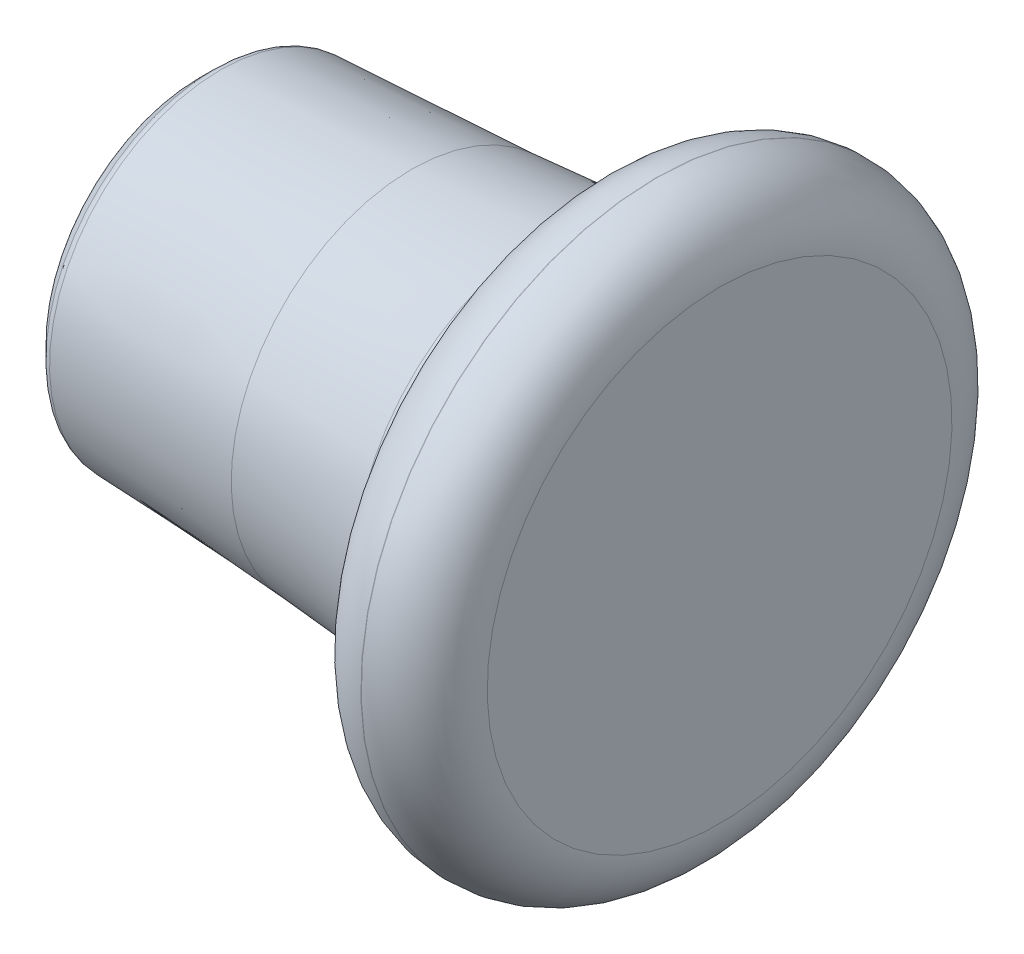
ISO-10303-21;
HEADER;
FILE_DESCRIPTION(('STEP AP214'),'2;1');
FILE_NAME('part.step','',(''),(''),'','','');
FILE_SCHEMA(('AUTOMOTIVE_DESIGN { 1 0 10303 214 1 1 1 1 }'));
ENDSEC;
DATA;
#1=APPLICATION_CONTEXT('core data for automotive mechanical design processes');
#2=APPLICATION_PROTOCOL_DEFINITION('international standard','automotive_design',2000,#1);
#3=PRODUCT_CONTEXT('',#1,'mechanical');
#4=PRODUCT('Part','Part','',(#3));
#5=PRODUCT_RELATED_PRODUCT_CATEGORY('part','',(#4));
#6=PRODUCT_DEFINITION_FORMATION('','',#4);
#7=PRODUCT_DEFINITION_CONTEXT('part definition',#1,'design');
#8=PRODUCT_DEFINITION('design','',#6,#7);
#9=PRODUCT_DEFINITION_SHAPE('','',#8);
#10=(LENGTH_UNIT() NAMED_UNIT(*) SI_UNIT(.MILLI.,.METRE.));
#11=(NAMED_UNIT(*) PLANE_ANGLE_UNIT() SI_UNIT($,.RADIAN.));
#12=(NAMED_UNIT(*) SI_UNIT($,.STERADIAN.) SOLID_ANGLE_UNIT());
#13=UNCERTAINTY_MEASURE_WITH_UNIT(LENGTH_MEASURE(1.E-05),#10,'distance_accuracy_value','');
#14=(GEOMETRIC_REPRESENTATION_CONTEXT(3) GLOBAL_UNCERTAINTY_ASSIGNED_CONTEXT((#13)) GLOBAL_UNIT_ASSIGNED_CONTEXT((#10,
#11,#12)) REPRESENTATION_CONTEXT('',''));
#15=CARTESIAN_POINT('',(0.,0.,0.));
#16=DIRECTION('',(0.,0.,1.));
#17=DIRECTION('',(1.,0.,0.));
#18=AXIS2_PLACEMENT_3D('',#15,#16,#17);
#19=CARTESIAN_POINT('',(-126.642185360927,125.,0.));
#20=DIRECTION('',(1.,0.,0.));
#21=DIRECTION('',(0.,1.,0.));
#22=AXIS2_PLACEMENT_3D('',#19,#20,#21);
#23=TOROIDAL_SURFACE('',#22,40.8262143641939,2.49999999999999);
#24=CARTESIAN_POINT('',(-128.409952313894,125.,0.));
#25=DIRECTION('',(1.,0.,0.));
#26=DIRECTION('',(0.,1.,0.));
#27=AXIS2_PLACEMENT_3D('',#24,#25,#26);
#28=CIRCLE('',#27,42.5939813171604);
#29=CARTESIAN_POINT('',(-128.409952313894,167.59398131716,0.));
#30=VERTEX_POINT('',#29);
#31=EDGE_CURVE('E80',#30,#30,#28,.T.);
#32=ORIENTED_EDGE('',*,*,#31,.T.);
#33=EDGE_LOOP('',(#32));
#34=FACE_BOUND('',#33,.T.);
#35=CARTESIAN_POINT('',(-126.767029403287,125.,0.));
#36=DIRECTION('',(1.,0.,0.));
#37=DIRECTION('',(0.,1.,0.));
#38=AXIS2_PLACEMENT_3D('',#35,#36,#37);
#39=CIRCLE('',#38,43.3230952113884);
#40=CARTESIAN_POINT('',(-126.767029403287,168.323095211388,0.));
#41=VERTEX_POINT('',#40);
#42=EDGE_CURVE('E10',#41,#41,#39,.T.);
#43=ORIENTED_EDGE('',*,*,#42,.F.);
#44=EDGE_LOOP('',(#43));
#45=FACE_BOUND('',#44,.T.);
#46=ADVANCED_FACE('F37',(#34,#45),#23,.T.);
#47=CARTESIAN_POINT('',(-126.767029403287,125.,0.));
#48=DIRECTION('',(1.,0.,0.));
#49=DIRECTION('',(0.,1.,0.));
#50=AXIS2_PLACEMENT_3D('',#47,#48,#49);
#51=CONICAL_SURFACE('',#50,43.3230952113884,0.049958395721942);
#52=CARTESIAN_POINT('',(-78.2289336310536,125.,0.));
#53=DIRECTION('',(1.,0.,0.));
#54=DIRECTION('',(0.,1.,0.));
#55=AXIS2_PLACEMENT_3D('',#52,#53,#54);
#56=CIRCLE('',#55,45.75);
#57=CARTESIAN_POINT('',(-78.2289336310536,170.75,0.));
#58=VERTEX_POINT('',#57);
#59=EDGE_CURVE('E43',#58,#58,#56,.T.);
#60=ORIENTED_EDGE('',*,*,#59,.F.);
#61=EDGE_LOOP('',(#60));
#62=FACE_BOUND('',#61,.T.);
#63=ORIENTED_EDGE('',*,*,#42,.T.);
#64=EDGE_LOOP('',(#63));
#65=FACE_BOUND('',#64,.T.);
#66=ADVANCED_FACE('F104',(#62,#65),#51,.T.);
#67=CARTESIAN_POINT('',(-93.2102187142211,125.,0.));
#68=DIRECTION('',(1.,0.,0.));
#69=DIRECTION('',(0.,1.,0.));
#70=AXIS2_PLACEMENT_3D('',#67,#68,#69);
#71=TOROIDAL_SURFACE('',#70,345.375701663353,300.);
#72=ORIENTED_EDGE('',*,*,#59,.T.);
#73=EDGE_LOOP('',(#72));
#74=FACE_BOUND('',#73,.T.);
#75=CARTESIAN_POINT('',(-43.1230355182371,125.,0.));
#76=DIRECTION('',(1.,0.,0.));
#77=DIRECTION('',(0.,1.,0.));
#78=AXIS2_PLACEMENT_3D('',#75,#76,#77);
#79=CIRCLE('',#78,49.5864623738013);
#80=CARTESIAN_POINT('',(-43.1230355182371,174.586462373801,0.));
#81=VERTEX_POINT('',#80);
#82=EDGE_CURVE('E47',#81,#81,#79,.T.);
#83=ORIENTED_EDGE('',*,*,#82,.F.);
#84=EDGE_LOOP('',(#83));
#85=FACE_BOUND('',#84,.T.);
#86=ADVANCED_FACE('F108',(#74,#85),#71,.F.);
#87=CARTESIAN_POINT('',(-44.7926082914366,125.,0.));
#88=DIRECTION('',(1.,0.,0.));
#89=DIRECTION('',(0.,1.,0.));
#90=AXIS2_PLACEMENT_3D('',#87,#88,#89);
#91=TOROIDAL_SURFACE('',#90,59.4461036834531,9.99999999999997);
#92=ORIENTED_EDGE('',*,*,#82,.T.);
#93=EDGE_LOOP('',(#92));
#94=FACE_BOUND('',#93,.T.);
#95=CARTESIAN_POINT('',(-39.1692863776974,125.,0.));
#96=DIRECTION('',(1.,0.,0.));
#97=DIRECTION('',(0.,1.,0.));
#98=AXIS2_PLACEMENT_3D('',#95,#96,#97);
#99=CIRCLE('',#98,51.1769894228772);
#100=CARTESIAN_POINT('',(-39.1692863776974,176.176989422877,0.));
#101=VERTEX_POINT('',#100);
#102=EDGE_CURVE('E51',#101,#101,#99,.T.);
#103=ORIENTED_EDGE('',*,*,#102,.F.);
#104=EDGE_LOOP('',(#103));
#105=FACE_BOUND('',#104,.T.);
#106=ADVANCED_FACE('F113',(#94,#105),#91,.F.);
#107=CARTESIAN_POINT('',(-48.7289336310541,125.,0.));
#108=DIRECTION('',(1.,0.,0.));
#109=DIRECTION('',(0.,1.,0.));
#110=AXIS2_PLACEMENT_3D('',#107,#108,#109);
#111=TOROIDAL_SURFACE('',#110,65.2344836658562,17.);
#112=ORIENTED_EDGE('',*,*,#102,.T.);
#113=EDGE_LOOP('',(#112));
#114=FACE_BOUND('',#113,.T.);
#115=CARTESIAN_POINT('',(-32.7541590776937,125.,0.));
#116=DIRECTION('',(1.,0.,0.));
#117=DIRECTION('',(0.,1.,0.));
#118=AXIS2_PLACEMENT_3D('',#115,#116,#117);
#119=CIRCLE('',#118,59.4201412293197);
#120=CARTESIAN_POINT('',(-32.7541590776937,184.42014122932,0.));
#121=VERTEX_POINT('',#120);
#122=EDGE_CURVE('E56',#121,#121,#119,.T.);
#123=ORIENTED_EDGE('',*,*,#122,.F.);
#124=EDGE_LOOP('',(#123));
#125=FACE_BOUND('',#124,.T.);
#126=ADVANCED_FACE('F118',(#114,#125),#111,.F.);
#127=CARTESIAN_POINT('',(-32.0567613252065,125.,0.));
#128=DIRECTION('',(1.,0.,0.));
#129=DIRECTION('',(0.,1.,0.));
#130=AXIS2_PLACEMENT_3D('',#127,#128,#129);
#131=CONICAL_SURFACE('',#130,61.3362258066565,1.22173047639602);
#132=ORIENTED_EDGE('',*,*,#122,.T.);
#133=EDGE_LOOP('',(#132));
#134=FACE_BOUND('',#133,.T.);
#135=CARTESIAN_POINT('',(-32.0567613252065,125.,0.));
#136=DIRECTION('',(1.,0.,0.));
#137=DIRECTION('',(0.,1.,0.));
#138=AXIS2_PLACEMENT_3D('',#135,#136,#137);
#139=CIRCLE('',#138,61.3362258066565);
#140=CARTESIAN_POINT('',(-32.0567613252065,186.336225806656,0.));
#141=VERTEX_POINT('',#140);
#142=EDGE_CURVE('E59',#141,#141,#139,.T.);
#143=ORIENTED_EDGE('',*,*,#142,.F.);
#144=EDGE_LOOP('',(#143));
#145=FACE_BOUND('',#144,.T.);
#146=ADVANCED_FACE('F122',(#134,#145),#131,.T.);
#147=CARTESIAN_POINT('',(-41.4536875330656,125.,0.));
#148=DIRECTION('',(1.,0.,0.));
#149=DIRECTION('',(0.,1.,0.));
#150=AXIS2_PLACEMENT_3D('',#147,#148,#149);
#151=TOROIDAL_SURFACE('',#150,64.7564272399133,10.);
#152=ORIENTED_EDGE('',*,*,#142,.T.);
#153=EDGE_LOOP('',(#152));
#154=FACE_BOUND('',#153,.T.);
#155=CARTESIAN_POINT('',(-31.7018591092149,125.,0.));
#156=DIRECTION('',(1.,0.,0.));
#157=DIRECTION('',(0.,1.,0.));
#158=AXIS2_PLACEMENT_3D('',#155,#156,#157);
#159=CIRCLE('',#158,62.5424167630236);
#160=CARTESIAN_POINT('',(-31.7018591092149,187.542416763023,0.));
#161=VERTEX_POINT('',#160);
#162=EDGE_CURVE('E62',#161,#161,#159,.T.);
#163=ORIENTED_EDGE('',*,*,#162,.F.);
#164=EDGE_LOOP('',(#163));
#165=FACE_BOUND('',#164,.T.);
#166=ADVANCED_FACE('F126',(#154,#165),#151,.F.);
#167=CARTESIAN_POINT('',(-16.0989336310538,125.,0.));
#168=DIRECTION('',(1.,0.,0.));
#169=DIRECTION('',(0.,1.,0.));
#170=AXIS2_PLACEMENT_3D('',#167,#168,#169);
#171=TOROIDAL_SURFACE('',#170,59.,16.);
#172=CARTESIAN_POINT('',(-16.0989336310538,125.,0.));
#173=DIRECTION('',(1.,0.,0.));
#174=DIRECTION('',(0.,1.,0.));
#175=AXIS2_PLACEMENT_3D('',#172,#173,#174);
#176=CIRCLE('',#175,75.);
#177=CARTESIAN_POINT('',(-16.0989336310538,200.,0.));
#178=VERTEX_POINT('',#177);
#179=EDGE_CURVE('E65',#178,#178,#176,.T.);
#180=ORIENTED_EDGE('',*,*,#179,.F.);
#181=EDGE_LOOP('',(#180));
#182=FACE_BOUND('',#181,.T.);
#183=ORIENTED_EDGE('',*,*,#162,.T.);
#184=EDGE_LOOP('',(#183));
#185=FACE_BOUND('',#184,.T.);
#186=ADVANCED_FACE('F130',(#182,#185),#171,.T.);
#187=CARTESIAN_POINT('',(0.,125.,0.));
#188=DIRECTION('',(1.,0.,0.));
#189=DIRECTION('',(0.,1.,0.));
#190=AXIS2_PLACEMENT_3D('',#187,#188,#189);
#191=CYLINDRICAL_SURFACE('',#190,75.);
#192=ORIENTED_EDGE('',*,*,#179,.T.);
#193=EDGE_LOOP('',(#192));
#194=FACE_BOUND('',#193,.T.);
#195=CARTESIAN_POINT('',(-16.,125.,0.));
#196=DIRECTION('',(1.,0.,0.));
#197=DIRECTION('',(0.,1.,0.));
#198=AXIS2_PLACEMENT_3D('',#195,#196,#197);
#199=CIRCLE('',#198,75.);
#200=CARTESIAN_POINT('',(-16.,200.,0.));
#201=VERTEX_POINT('',#200);
#202=EDGE_CURVE('E68',#201,#201,#199,.T.);
#203=ORIENTED_EDGE('',*,*,#202,.F.);
#204=EDGE_LOOP('',(#203));
#205=FACE_BOUND('',#204,.T.);
#206=ADVANCED_FACE('F134',(#194,#205),#191,.T.);
#207=CARTESIAN_POINT('',(-16.,125.,0.));
#208=DIRECTION('',(1.,0.,0.));
#209=DIRECTION('',(0.,1.,0.));
#210=AXIS2_PLACEMENT_3D('',#207,#208,#209);
#211=TOROIDAL_SURFACE('',#210,59.,16.);
#212=CARTESIAN_POINT('',(0.,125.,0.));
#213=DIRECTION('',(1.,0.,0.));
#214=DIRECTION('',(0.,1.,0.));
#215=AXIS2_PLACEMENT_3D('',#212,#213,#214);
#216=CIRCLE('',#215,59.);
#217=CARTESIAN_POINT('',(0.,184.,0.));
#218=VERTEX_POINT('',#217);
#219=EDGE_CURVE('E71',#218,#218,#216,.T.);
#220=ORIENTED_EDGE('',*,*,#219,.F.);
#221=EDGE_LOOP('',(#220));
#222=FACE_BOUND('',#221,.T.);
#223=ORIENTED_EDGE('',*,*,#202,.T.);
#224=EDGE_LOOP('',(#223));
#225=FACE_BOUND('',#224,.T.);
#226=ADVANCED_FACE('F138',(#222,#225),#211,.T.);
#227=CARTESIAN_POINT('',(0.,0.,0.));
#228=DIRECTION('',(1.,0.,0.));
#229=DIRECTION('',(0.,1.,0.));
#230=AXIS2_PLACEMENT_3D('',#227,#228,#229);
#231=PLANE('',#230);
#232=ORIENTED_EDGE('',*,*,#219,.T.);
#233=EDGE_LOOP('',(#232));
#234=FACE_BOUND('',#233,.T.);
#235=ADVANCED_FACE('F100',(#234),#231,.T.);
#236=CARTESIAN_POINT('',(-132.728933631054,1.08195012077153E-12,0.));
#237=DIRECTION('',(-1.,0.,0.));
#238=DIRECTION('',(0.,-1.,0.));
#239=AXIS2_PLACEMENT_3D('',#236,#237,#238);
#240=PLANE('',#239);
#241=CARTESIAN_POINT('',(-132.728933631053,125.,0.));
#242=DIRECTION('',(1.,0.,0.));
#243=DIRECTION('',(0.,1.,0.));
#244=AXIS2_PLACEMENT_3D('',#241,#242,#243);
#245=CIRCLE('',#244,37.2394660940675);
#246=CARTESIAN_POINT('',(-132.728933631053,162.239466094067,0.));
#247=VERTEX_POINT('',#246);
#248=EDGE_CURVE('E74',#247,#247,#245,.T.);
#249=ORIENTED_EDGE('',*,*,#248,.F.);
#250=EDGE_LOOP('',(#249));
#251=FACE_BOUND('',#250,.T.);
#252=ADVANCED_FACE('F94',(#251),#240,.T.);
#253=CARTESIAN_POINT('',(-130.228933631054,125.,0.));
#254=DIRECTION('',(1.,0.,0.));
#255=DIRECTION('',(0.,1.,0.));
#256=AXIS2_PLACEMENT_3D('',#253,#254,#255);
#257=TOROIDAL_SURFACE('',#256,37.2394660940674,2.49999999999986);
#258=ORIENTED_EDGE('',*,*,#248,.T.);
#259=EDGE_LOOP('',(#258));
#260=FACE_BOUND('',#259,.T.);
#261=CARTESIAN_POINT('',(-131.99670058402,125.,0.));
#262=DIRECTION('',(1.,0.,0.));
#263=DIRECTION('',(0.,1.,0.));
#264=AXIS2_PLACEMENT_3D('',#261,#262,#263);
#265=CIRCLE('',#264,39.0072330470337);
#266=CARTESIAN_POINT('',(-131.99670058402,164.007233047034,0.));
#267=VERTEX_POINT('',#266);
#268=EDGE_CURVE('E77',#267,#267,#265,.T.);
#269=ORIENTED_EDGE('',*,*,#268,.F.);
#270=EDGE_LOOP('',(#269));
#271=FACE_BOUND('',#270,.T.);
#272=ADVANCED_FACE('F89',(#260,#271),#257,.T.);
#273=CARTESIAN_POINT('',(-131.99670058402,125.,0.));
#274=DIRECTION('',(1.,0.,0.));
#275=DIRECTION('',(0.,1.,0.));
#276=AXIS2_PLACEMENT_3D('',#273,#274,#275);
#277=CONICAL_SURFACE('',#276,39.0072330470337,0.785398163397471);
#278=ORIENTED_EDGE('',*,*,#31,.F.);
#279=EDGE_LOOP('',(#278));
#280=FACE_BOUND('',#279,.T.);
#281=ORIENTED_EDGE('',*,*,#268,.T.);
#282=EDGE_LOOP('',(#281));
#283=FACE_BOUND('',#282,.T.);
#284=ADVANCED_FACE('F86',(#280,#283),#277,.T.);
#285=CLOSED_SHELL('',(#46,#66,#86,#106,#126,#146,#166,#186,#206,#226,#235,#252,#272,#284));
#286=MANIFOLD_SOLID_BREP('B2',#285);
#287=ADVANCED_BREP_SHAPE_REPRESENTATION('',(#18,#286),#14);
#288=SHAPE_DEFINITION_REPRESENTATION(#9,#287);
ENDSEC;
END-ISO-10303-21;
